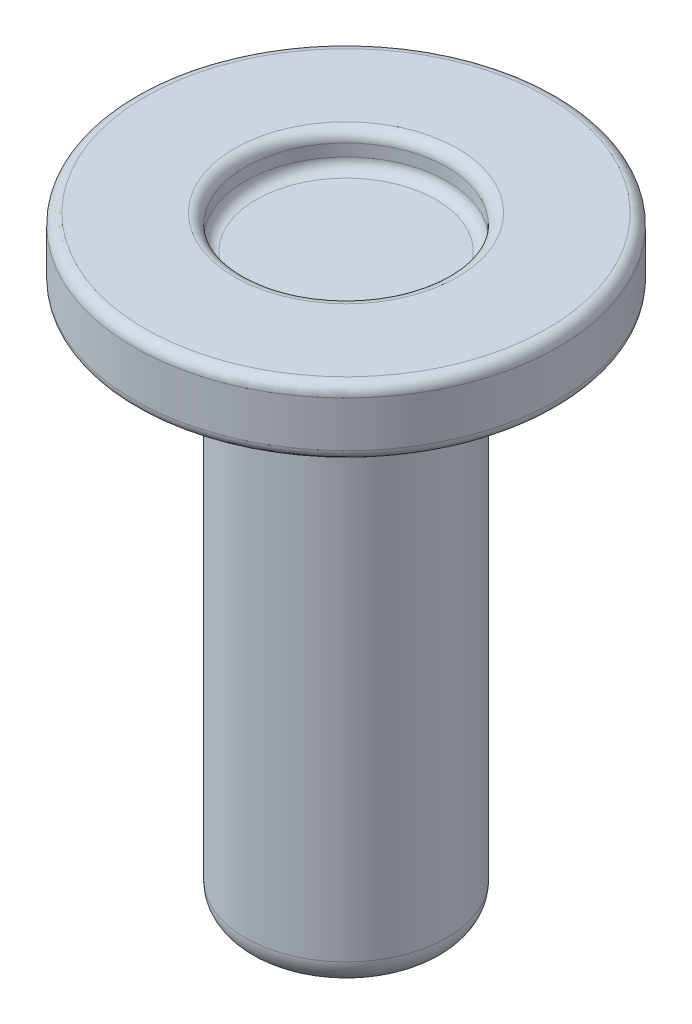
ISO-10303-21;
HEADER;
FILE_DESCRIPTION(('STEP AP214'),'2;1');
FILE_NAME('part.step','',(''),(''),'','','');
FILE_SCHEMA(('AUTOMOTIVE_DESIGN { 1 0 10303 214 1 1 1 1 }'));
ENDSEC;
DATA;
#1=APPLICATION_CONTEXT('core data for automotive mechanical design processes');
#2=APPLICATION_PROTOCOL_DEFINITION('international standard','automotive_design',2000,#1);
#3=PRODUCT_CONTEXT('',#1,'mechanical');
#4=PRODUCT('Part','Part','',(#3));
#5=PRODUCT_RELATED_PRODUCT_CATEGORY('part','',(#4));
#6=PRODUCT_DEFINITION_FORMATION('','',#4);
#7=PRODUCT_DEFINITION_CONTEXT('part definition',#1,'design');
#8=PRODUCT_DEFINITION('design','',#6,#7);
#9=PRODUCT_DEFINITION_SHAPE('','',#8);
#10=(LENGTH_UNIT() NAMED_UNIT(*) SI_UNIT(.MILLI.,.METRE.));
#11=(NAMED_UNIT(*) PLANE_ANGLE_UNIT() SI_UNIT($,.RADIAN.));
#12=(NAMED_UNIT(*) SI_UNIT($,.STERADIAN.) SOLID_ANGLE_UNIT());
#13=UNCERTAINTY_MEASURE_WITH_UNIT(LENGTH_MEASURE(1.E-05),#10,'distance_accuracy_value','');
#14=(GEOMETRIC_REPRESENTATION_CONTEXT(3) GLOBAL_UNCERTAINTY_ASSIGNED_CONTEXT((#13)) GLOBAL_UNIT_ASSIGNED_CONTEXT((#10,
#11,#12)) REPRESENTATION_CONTEXT('',''));
#15=CARTESIAN_POINT('',(0.,0.,0.));
#16=DIRECTION('',(0.,0.,1.));
#17=DIRECTION('',(1.,0.,0.));
#18=AXIS2_PLACEMENT_3D('',#15,#16,#17);
#19=CARTESIAN_POINT('',(-1.74625,-13.49375,0.));
#20=DIRECTION('',(0.,1.,0.));
#21=DIRECTION('',(0.,0.,1.));
#22=AXIS2_PLACEMENT_3D('',#19,#20,#21);
#23=PLANE('',#22);
#24=CARTESIAN_POINT('',(0.,-13.49375,0.));
#25=DIRECTION('',(0.,-1.,0.));
#26=DIRECTION('',(0.,0.,-1.));
#27=AXIS2_PLACEMENT_3D('',#24,#25,#26);
#28=CIRCLE('',#27,1.74625);
#29=CARTESIAN_POINT('',(0.,-13.49375,-1.74625));
#30=VERTEX_POINT('',#29);
#31=EDGE_CURVE('E10',#30,#30,#28,.T.);
#32=ORIENTED_EDGE('',*,*,#31,.T.);
#33=EDGE_LOOP('',(#32));
#34=FACE_BOUND('',#33,.T.);
#35=ADVANCED_FACE('F31',(#34),#23,.F.);
#36=CARTESIAN_POINT('',(0.,-12.85875,0.));
#37=DIRECTION('',(0.,-1.,0.));
#38=DIRECTION('',(0.,0.,-1.));
#39=AXIS2_PLACEMENT_3D('',#36,#37,#38);
#40=TOROIDAL_SURFACE('',#39,1.74625,0.635);
#41=ORIENTED_EDGE('',*,*,#31,.F.);
#42=EDGE_LOOP('',(#41));
#43=FACE_BOUND('',#42,.T.);
#44=CARTESIAN_POINT('',(0.,-12.85875,0.));
#45=DIRECTION('',(0.,-1.,0.));
#46=DIRECTION('',(0.,0.,-1.));
#47=AXIS2_PLACEMENT_3D('',#44,#45,#46);
#48=CIRCLE('',#47,2.38125);
#49=CARTESIAN_POINT('',(0.,-12.85875,-2.38125));
#50=VERTEX_POINT('',#49);
#51=EDGE_CURVE('E37',#50,#50,#48,.T.);
#52=ORIENTED_EDGE('',*,*,#51,.T.);
#53=EDGE_LOOP('',(#52));
#54=FACE_BOUND('',#53,.T.);
#55=ADVANCED_FACE('F87',(#43,#54),#40,.T.);
#56=CARTESIAN_POINT('',(0.,-13.49375,0.));
#57=DIRECTION('',(0.,-1.,0.));
#58=DIRECTION('',(0.,0.,-1.));
#59=AXIS2_PLACEMENT_3D('',#56,#57,#58);
#60=CYLINDRICAL_SURFACE('',#59,2.38125);
#61=ORIENTED_EDGE('',*,*,#51,.F.);
#62=EDGE_LOOP('',(#61));
#63=FACE_BOUND('',#62,.T.);
#64=CARTESIAN_POINT('',(0.,-1.04775,0.));
#65=DIRECTION('',(0.,-1.,0.));
#66=DIRECTION('',(0.,0.,-1.));
#67=AXIS2_PLACEMENT_3D('',#64,#65,#66);
#68=CIRCLE('',#67,2.38125);
#69=CARTESIAN_POINT('',(0.,-1.04775,-2.38125));
#70=VERTEX_POINT('',#69);
#71=EDGE_CURVE('E41',#70,#70,#68,.T.);
#72=ORIENTED_EDGE('',*,*,#71,.T.);
#73=EDGE_LOOP('',(#72));
#74=FACE_BOUND('',#73,.T.);
#75=ADVANCED_FACE('F91',(#63,#74),#60,.T.);
#76=CARTESIAN_POINT('',(0.,-1.04775,0.));
#77=DIRECTION('',(0.,-1.,0.));
#78=DIRECTION('',(0.,0.,-1.));
#79=AXIS2_PLACEMENT_3D('',#76,#77,#78);
#80=TOROIDAL_SURFACE('',#79,2.63525,0.254);
#81=ORIENTED_EDGE('',*,*,#71,.F.);
#82=EDGE_LOOP('',(#81));
#83=FACE_BOUND('',#82,.T.);
#84=CARTESIAN_POINT('',(0.,-0.793750000000001,0.));
#85=DIRECTION('',(0.,-1.,0.));
#86=DIRECTION('',(0.,0.,-1.));
#87=AXIS2_PLACEMENT_3D('',#84,#85,#86);
#88=CIRCLE('',#87,2.63525);
#89=CARTESIAN_POINT('',(0.,-0.793750000000001,-2.63525));
#90=VERTEX_POINT('',#89);
#91=EDGE_CURVE('E45',#90,#90,#88,.T.);
#92=ORIENTED_EDGE('',*,*,#91,.T.);
#93=EDGE_LOOP('',(#92));
#94=FACE_BOUND('',#93,.T.);
#95=ADVANCED_FACE('F96',(#83,#94),#80,.F.);
#96=CARTESIAN_POINT('',(-4.7498,-0.79375,0.));
#97=DIRECTION('',(0.,1.,0.));
#98=DIRECTION('',(0.,0.,1.));
#99=AXIS2_PLACEMENT_3D('',#96,#97,#98);
#100=PLANE('',#99);
#101=ORIENTED_EDGE('',*,*,#91,.F.);
#102=EDGE_LOOP('',(#101));
#103=FACE_BOUND('',#102,.T.);
#104=CARTESIAN_POINT('',(0.,-0.793750000000001,0.));
#105=DIRECTION('',(0.,-1.,0.));
#106=DIRECTION('',(0.,0.,-1.));
#107=AXIS2_PLACEMENT_3D('',#104,#105,#106);
#108=CIRCLE('',#107,4.7498);
#109=CARTESIAN_POINT('',(0.,-0.793750000000001,-4.7498));
#110=VERTEX_POINT('',#109);
#111=EDGE_CURVE('E50',#110,#110,#108,.T.);
#112=ORIENTED_EDGE('',*,*,#111,.T.);
#113=EDGE_LOOP('',(#112));
#114=FACE_BOUND('',#113,.T.);
#115=ADVANCED_FACE('F102',(#103,#114),#100,.F.);
#116=CARTESIAN_POINT('',(0.,-0.53975,0.));
#117=DIRECTION('',(0.,-1.,0.));
#118=DIRECTION('',(0.,0.,-1.));
#119=AXIS2_PLACEMENT_3D('',#116,#117,#118);
#120=TOROIDAL_SURFACE('',#119,4.7498,0.254);
#121=ORIENTED_EDGE('',*,*,#111,.F.);
#122=EDGE_LOOP('',(#121));
#123=FACE_BOUND('',#122,.T.);
#124=CARTESIAN_POINT('',(0.,-0.539749999999999,0.));
#125=DIRECTION('',(0.,-1.,0.));
#126=DIRECTION('',(0.,0.,-1.));
#127=AXIS2_PLACEMENT_3D('',#124,#125,#126);
#128=CIRCLE('',#127,5.0038);
#129=CARTESIAN_POINT('',(0.,-0.539749999999999,-5.0038));
#130=VERTEX_POINT('',#129);
#131=EDGE_CURVE('E53',#130,#130,#128,.T.);
#132=ORIENTED_EDGE('',*,*,#131,.T.);
#133=EDGE_LOOP('',(#132));
#134=FACE_BOUND('',#133,.T.);
#135=ADVANCED_FACE('F106',(#123,#134),#120,.T.);
#136=CARTESIAN_POINT('',(0.,-13.49375,0.));
#137=DIRECTION('',(0.,-1.,0.));
#138=DIRECTION('',(0.,0.,-1.));
#139=AXIS2_PLACEMENT_3D('',#136,#137,#138);
#140=CYLINDRICAL_SURFACE('',#139,5.0038);
#141=ORIENTED_EDGE('',*,*,#131,.F.);
#142=EDGE_LOOP('',(#141));
#143=FACE_BOUND('',#142,.T.);
#144=CARTESIAN_POINT('',(0.,0.539749999999999,0.));
#145=DIRECTION('',(0.,-1.,0.));
#146=DIRECTION('',(0.,0.,-1.));
#147=AXIS2_PLACEMENT_3D('',#144,#145,#146);
#148=CIRCLE('',#147,5.0038);
#149=CARTESIAN_POINT('',(0.,0.539749999999999,-5.0038));
#150=VERTEX_POINT('',#149);
#151=EDGE_CURVE('E56',#150,#150,#148,.T.);
#152=ORIENTED_EDGE('',*,*,#151,.T.);
#153=EDGE_LOOP('',(#152));
#154=FACE_BOUND('',#153,.T.);
#155=ADVANCED_FACE('F110',(#143,#154),#140,.T.);
#156=CARTESIAN_POINT('',(0.,0.53975,0.));
#157=DIRECTION('',(0.,-1.,0.));
#158=DIRECTION('',(0.,0.,-1.));
#159=AXIS2_PLACEMENT_3D('',#156,#157,#158);
#160=TOROIDAL_SURFACE('',#159,4.7498,0.254);
#161=ORIENTED_EDGE('',*,*,#151,.F.);
#162=EDGE_LOOP('',(#161));
#163=FACE_BOUND('',#162,.T.);
#164=CARTESIAN_POINT('',(0.,0.793749999999999,0.));
#165=DIRECTION('',(0.,-1.,0.));
#166=DIRECTION('',(0.,0.,-1.));
#167=AXIS2_PLACEMENT_3D('',#164,#165,#166);
#168=CIRCLE('',#167,4.7498);
#169=CARTESIAN_POINT('',(0.,0.793749999999999,-4.7498));
#170=VERTEX_POINT('',#169);
#171=EDGE_CURVE('E59',#170,#170,#168,.T.);
#172=ORIENTED_EDGE('',*,*,#171,.T.);
#173=EDGE_LOOP('',(#172));
#174=FACE_BOUND('',#173,.T.);
#175=ADVANCED_FACE('F114',(#163,#174),#160,.T.);
#176=CARTESIAN_POINT('',(-2.63525,0.79375,0.));
#177=DIRECTION('',(0.,-1.,0.));
#178=DIRECTION('',(0.,0.,-1.));
#179=AXIS2_PLACEMENT_3D('',#176,#177,#178);
#180=PLANE('',#179);
#181=ORIENTED_EDGE('',*,*,#171,.F.);
#182=EDGE_LOOP('',(#181));
#183=FACE_BOUND('',#182,.T.);
#184=CARTESIAN_POINT('',(0.,0.793749999999999,0.));
#185=DIRECTION('',(0.,-1.,0.));
#186=DIRECTION('',(0.,0.,-1.));
#187=AXIS2_PLACEMENT_3D('',#184,#185,#186);
#188=CIRCLE('',#187,2.63525);
#189=CARTESIAN_POINT('',(0.,0.793749999999999,-2.63525));
#190=VERTEX_POINT('',#189);
#191=EDGE_CURVE('E62',#190,#190,#188,.T.);
#192=ORIENTED_EDGE('',*,*,#191,.T.);
#193=EDGE_LOOP('',(#192));
#194=FACE_BOUND('',#193,.T.);
#195=ADVANCED_FACE('F118',(#183,#194),#180,.F.);
#196=CARTESIAN_POINT('',(0.,0.53975,0.));
#197=DIRECTION('',(0.,-1.,0.));
#198=DIRECTION('',(0.,0.,-1.));
#199=AXIS2_PLACEMENT_3D('',#196,#197,#198);
#200=TOROIDAL_SURFACE('',#199,2.63525,0.254);
#201=ORIENTED_EDGE('',*,*,#191,.F.);
#202=EDGE_LOOP('',(#201));
#203=FACE_BOUND('',#202,.T.);
#204=CARTESIAN_POINT('',(0.,0.539749999999999,0.));
#205=DIRECTION('',(0.,-1.,0.));
#206=DIRECTION('',(0.,0.,-1.));
#207=AXIS2_PLACEMENT_3D('',#204,#205,#206);
#208=CIRCLE('',#207,2.38125);
#209=CARTESIAN_POINT('',(0.,0.539749999999999,-2.38125));
#210=VERTEX_POINT('',#209);
#211=EDGE_CURVE('E65',#210,#210,#208,.T.);
#212=ORIENTED_EDGE('',*,*,#211,.T.);
#213=EDGE_LOOP('',(#212));
#214=FACE_BOUND('',#213,.T.);
#215=ADVANCED_FACE('F122',(#203,#214),#200,.T.);
#216=CARTESIAN_POINT('',(0.,-13.49375,0.));
#217=DIRECTION('',(0.,-1.,0.));
#218=DIRECTION('',(0.,0.,-1.));
#219=AXIS2_PLACEMENT_3D('',#216,#217,#218);
#220=CYLINDRICAL_SURFACE('',#219,2.38125);
#221=ORIENTED_EDGE('',*,*,#211,.F.);
#222=EDGE_LOOP('',(#221));
#223=FACE_BOUND('',#222,.T.);
#224=CARTESIAN_POINT('',(0.,0.253999999999999,0.));
#225=DIRECTION('',(0.,-1.,0.));
#226=DIRECTION('',(0.,0.,-1.));
#227=AXIS2_PLACEMENT_3D('',#224,#225,#226);
#228=CIRCLE('',#227,2.38125);
#229=CARTESIAN_POINT('',(0.,0.253999999999999,-2.38125));
#230=VERTEX_POINT('',#229);
#231=EDGE_CURVE('E68',#230,#230,#228,.T.);
#232=ORIENTED_EDGE('',*,*,#231,.T.);
#233=EDGE_LOOP('',(#232));
#234=FACE_BOUND('',#233,.T.);
#235=ADVANCED_FACE('F83',(#223,#234),#220,.F.);
#236=CARTESIAN_POINT('',(0.,0.254,0.));
#237=DIRECTION('',(0.,-1.,0.));
#238=DIRECTION('',(0.,0.,-1.));
#239=AXIS2_PLACEMENT_3D('',#236,#237,#238);
#240=TOROIDAL_SURFACE('',#239,2.12725,0.254);
#241=ORIENTED_EDGE('',*,*,#231,.F.);
#242=EDGE_LOOP('',(#241));
#243=FACE_BOUND('',#242,.T.);
#244=CARTESIAN_POINT('',(0.,0.,0.));
#245=DIRECTION('',(0.,-1.,0.));
#246=DIRECTION('',(0.,0.,-1.));
#247=AXIS2_PLACEMENT_3D('',#244,#245,#246);
#248=CIRCLE('',#247,2.12725);
#249=CARTESIAN_POINT('',(0.,0.,-2.12725));
#250=VERTEX_POINT('',#249);
#251=EDGE_CURVE('E71',#250,#250,#248,.T.);
#252=ORIENTED_EDGE('',*,*,#251,.T.);
#253=EDGE_LOOP('',(#252));
#254=FACE_BOUND('',#253,.T.);
#255=ADVANCED_FACE('F75',(#243,#254),#240,.F.);
#256=CARTESIAN_POINT('',(0.,0.,0.));
#257=DIRECTION('',(0.,-1.,0.));
#258=DIRECTION('',(0.,0.,-1.));
#259=AXIS2_PLACEMENT_3D('',#256,#257,#258);
#260=PLANE('',#259);
#261=ORIENTED_EDGE('',*,*,#251,.F.);
#262=EDGE_LOOP('',(#261));
#263=FACE_BOUND('',#262,.T.);
#264=ADVANCED_FACE('F77',(#263),#260,.F.);
#265=CLOSED_SHELL('',(#35,#55,#75,#95,#115,#135,#155,#175,#195,#215,#235,#255,#264));
#266=MANIFOLD_SOLID_BREP('B2',#265);
#267=ADVANCED_BREP_SHAPE_REPRESENTATION('',(#18,#266),#14);
#268=SHAPE_DEFINITION_REPRESENTATION(#9,#267);
ENDSEC;
END-ISO-10303-21;
